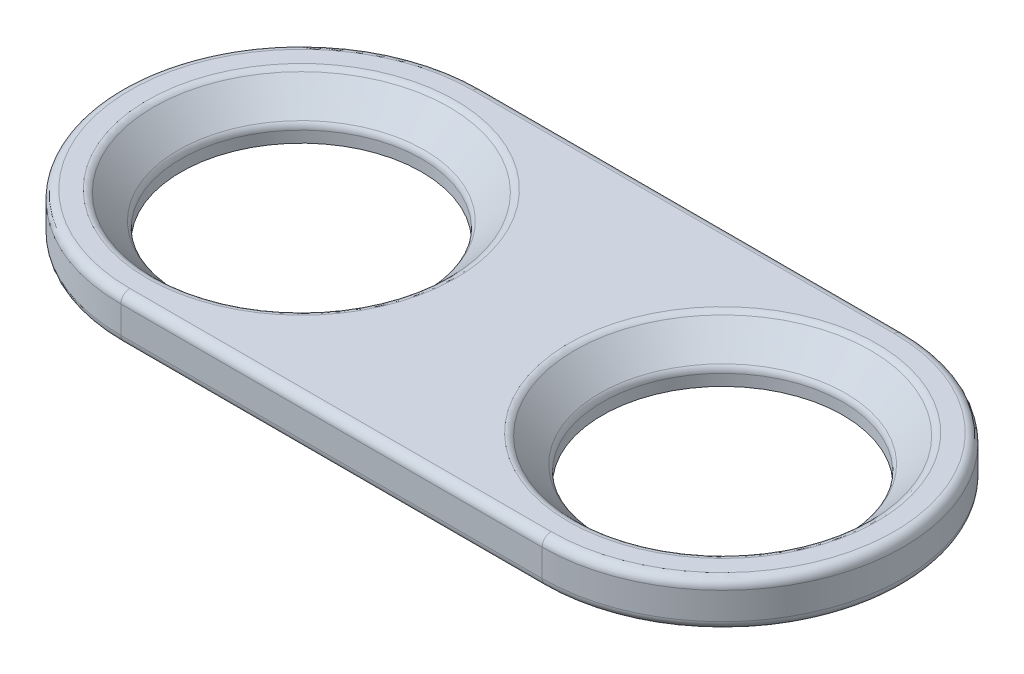
ISO-10303-21;
HEADER;
FILE_DESCRIPTION(('STEP AP214'),'2;1');
FILE_NAME('part.step','',(''),(''),'','','');
FILE_SCHEMA(('AUTOMOTIVE_DESIGN { 1 0 10303 214 1 1 1 1 }'));
ENDSEC;
DATA;
#1=APPLICATION_CONTEXT('core data for automotive mechanical design processes');
#2=APPLICATION_PROTOCOL_DEFINITION('international standard','automotive_design',2000,#1);
#3=PRODUCT_CONTEXT('',#1,'mechanical');
#4=PRODUCT('Part','Part','',(#3));
#5=PRODUCT_RELATED_PRODUCT_CATEGORY('part','',(#4));
#6=PRODUCT_DEFINITION_FORMATION('','',#4);
#7=PRODUCT_DEFINITION_CONTEXT('part definition',#1,'design');
#8=PRODUCT_DEFINITION('design','',#6,#7);
#9=PRODUCT_DEFINITION_SHAPE('','',#8);
#10=(LENGTH_UNIT() NAMED_UNIT(*) SI_UNIT(.MILLI.,.METRE.));
#11=(NAMED_UNIT(*) PLANE_ANGLE_UNIT() SI_UNIT($,.RADIAN.));
#12=(NAMED_UNIT(*) SI_UNIT($,.STERADIAN.) SOLID_ANGLE_UNIT());
#13=UNCERTAINTY_MEASURE_WITH_UNIT(LENGTH_MEASURE(1.E-05),#10,'distance_accuracy_value','');
#14=(GEOMETRIC_REPRESENTATION_CONTEXT(3) GLOBAL_UNCERTAINTY_ASSIGNED_CONTEXT((#13)) GLOBAL_UNIT_ASSIGNED_CONTEXT((#10,
#11,#12)) REPRESENTATION_CONTEXT('',''));
#15=CARTESIAN_POINT('',(0.,0.,0.));
#16=DIRECTION('',(0.,0.,1.));
#17=DIRECTION('',(1.,0.,0.));
#18=AXIS2_PLACEMENT_3D('',#15,#16,#17);
#19=CARTESIAN_POINT('',(-7.,1.5,0.));
#20=DIRECTION('',(0.,1.,0.));
#21=DIRECTION('',(0.,0.,1.));
#22=AXIS2_PLACEMENT_3D('',#19,#20,#21);
#23=PLANE('',#22);
#24=DIRECTION('',(-1.,0.,0.));
#25=VECTOR('',#24,1.);
#26=CARTESIAN_POINT('',(-7.,1.5,-5.7));
#27=LINE('',#26,#25);
#28=CARTESIAN_POINT('',(7.,1.5,-5.7));
#29=VERTEX_POINT('',#28);
#30=CARTESIAN_POINT('',(-7.,1.5,-5.7));
#31=VERTEX_POINT('',#30);
#32=EDGE_CURVE('E50',#29,#31,#27,.T.);
#33=ORIENTED_EDGE('',*,*,#32,.T.);
#34=CARTESIAN_POINT('',(-7.,1.5,0.));
#35=DIRECTION('',(0.,1.,0.));
#36=DIRECTION('',(0.,0.,1.));
#37=AXIS2_PLACEMENT_3D('',#34,#35,#36);
#38=CIRCLE('',#37,5.7);
#39=CARTESIAN_POINT('',(-7.,1.5,5.7));
#40=VERTEX_POINT('',#39);
#41=EDGE_CURVE('E106',#31,#40,#38,.T.);
#42=ORIENTED_EDGE('',*,*,#41,.T.);
#43=DIRECTION('',(1.,0.,0.));
#44=VECTOR('',#43,1.);
#45=CARTESIAN_POINT('',(7.,1.5,5.7));
#46=LINE('',#45,#44);
#47=CARTESIAN_POINT('',(7.,1.5,5.7));
#48=VERTEX_POINT('',#47);
#49=EDGE_CURVE('E170',#40,#48,#46,.T.);
#50=ORIENTED_EDGE('',*,*,#49,.T.);
#51=CARTESIAN_POINT('',(7.,1.5,0.));
#52=DIRECTION('',(0.,1.,0.));
#53=DIRECTION('',(0.,0.,1.));
#54=AXIS2_PLACEMENT_3D('',#51,#52,#53);
#55=CIRCLE('',#54,5.7);
#56=EDGE_CURVE('E55',#48,#29,#55,.T.);
#57=ORIENTED_EDGE('',*,*,#56,.T.);
#58=EDGE_LOOP('',(#33,#42,#50,#57));
#59=FACE_BOUND('',#58,.T.);
#60=CARTESIAN_POINT('',(7.,1.5,0.));
#61=DIRECTION('',(0.,1.,0.));
#62=DIRECTION('',(0.,0.,1.));
#63=AXIS2_PLACEMENT_3D('',#60,#61,#62);
#64=CIRCLE('',#63,5.12426406871194);
#65=CARTESIAN_POINT('',(7.,1.5,5.12426406871194));
#66=VERTEX_POINT('',#65);
#67=EDGE_CURVE('E167',#66,#66,#64,.F.);
#68=ORIENTED_EDGE('',*,*,#67,.T.);
#69=EDGE_LOOP('',(#68));
#70=FACE_BOUND('',#69,.T.);
#71=CARTESIAN_POINT('',(-7.,1.5,0.));
#72=DIRECTION('',(0.,1.,0.));
#73=DIRECTION('',(0.,0.,1.));
#74=AXIS2_PLACEMENT_3D('',#71,#72,#73);
#75=CIRCLE('',#74,5.12426406871194);
#76=CARTESIAN_POINT('',(-7.,1.5,5.12426406871194));
#77=VERTEX_POINT('',#76);
#78=EDGE_CURVE('E164',#77,#77,#75,.F.);
#79=ORIENTED_EDGE('',*,*,#78,.T.);
#80=EDGE_LOOP('',(#79));
#81=FACE_BOUND('',#80,.T.);
#82=ADVANCED_FACE('F33',(#59,#70,#81),#23,.T.);
#83=CARTESIAN_POINT('',(-7.,0.,0.));
#84=DIRECTION('',(0.,1.,0.));
#85=DIRECTION('',(0.,0.,1.));
#86=AXIS2_PLACEMENT_3D('',#83,#84,#85);
#87=PLANE('',#86);
#88=CARTESIAN_POINT('',(-7.,0.,0.));
#89=DIRECTION('',(0.,1.,0.));
#90=DIRECTION('',(0.,0.,1.));
#91=AXIS2_PLACEMENT_3D('',#88,#89,#90);
#92=CIRCLE('',#91,5.7);
#93=CARTESIAN_POINT('',(-7.,0.,5.7));
#94=VERTEX_POINT('',#93);
#95=CARTESIAN_POINT('',(-7.,0.,-5.7));
#96=VERTEX_POINT('',#95);
#97=EDGE_CURVE('E147',#94,#96,#92,.F.);
#98=ORIENTED_EDGE('',*,*,#97,.T.);
#99=DIRECTION('',(-1.,0.,0.));
#100=VECTOR('',#99,1.);
#101=CARTESIAN_POINT('',(-7.,0.,-5.7));
#102=LINE('',#101,#100);
#103=CARTESIAN_POINT('',(7.,0.,-5.7));
#104=VERTEX_POINT('',#103);
#105=EDGE_CURVE('E153',#96,#104,#102,.F.);
#106=ORIENTED_EDGE('',*,*,#105,.T.);
#107=CARTESIAN_POINT('',(7.,0.,0.));
#108=DIRECTION('',(0.,1.,0.));
#109=DIRECTION('',(0.,0.,1.));
#110=AXIS2_PLACEMENT_3D('',#107,#108,#109);
#111=CIRCLE('',#110,5.7);
#112=CARTESIAN_POINT('',(7.,0.,5.7));
#113=VERTEX_POINT('',#112);
#114=EDGE_CURVE('E151',#104,#113,#111,.F.);
#115=ORIENTED_EDGE('',*,*,#114,.T.);
#116=DIRECTION('',(1.,0.,0.));
#117=VECTOR('',#116,1.);
#118=CARTESIAN_POINT('',(-7.,0.,5.7));
#119=LINE('',#118,#117);
#120=EDGE_CURVE('E149',#113,#94,#119,.F.);
#121=ORIENTED_EDGE('',*,*,#120,.T.);
#122=EDGE_LOOP('',(#98,#106,#115,#121));
#123=FACE_BOUND('',#122,.T.);
#124=CARTESIAN_POINT('',(-7.,0.,0.));
#125=DIRECTION('',(0.,1.,0.));
#126=DIRECTION('',(0.,0.,1.));
#127=AXIS2_PLACEMENT_3D('',#124,#125,#126);
#128=CIRCLE('',#127,4.);
#129=CARTESIAN_POINT('',(-7.,0.,4.));
#130=VERTEX_POINT('',#129);
#131=EDGE_CURVE('E134',#130,#130,#128,.T.);
#132=ORIENTED_EDGE('',*,*,#131,.T.);
#133=EDGE_LOOP('',(#132));
#134=FACE_BOUND('',#133,.T.);
#135=CARTESIAN_POINT('',(7.,0.,0.));
#136=DIRECTION('',(0.,1.,0.));
#137=DIRECTION('',(0.,0.,1.));
#138=AXIS2_PLACEMENT_3D('',#135,#136,#137);
#139=CIRCLE('',#138,4.);
#140=CARTESIAN_POINT('',(7.,0.,4.));
#141=VERTEX_POINT('',#140);
#142=EDGE_CURVE('E139',#141,#141,#139,.T.);
#143=ORIENTED_EDGE('',*,*,#142,.T.);
#144=EDGE_LOOP('',(#143));
#145=FACE_BOUND('',#144,.T.);
#146=ADVANCED_FACE('F227',(#123,#134,#145),#87,.F.);
#147=CARTESIAN_POINT('',(-7.,1.5,0.));
#148=DIRECTION('',(0.,-1.,0.));
#149=DIRECTION('',(0.,0.,-1.));
#150=AXIS2_PLACEMENT_3D('',#147,#148,#149);
#151=CYLINDRICAL_SURFACE('',#150,6.);
#152=DIRECTION('',(0.,-1.,0.));
#153=VECTOR('',#152,1.);
#154=CARTESIAN_POINT('',(-7.,1.5,6.));
#155=LINE('',#154,#153);
#156=CARTESIAN_POINT('',(-7.,1.2,6.));
#157=VERTEX_POINT('',#156);
#158=CARTESIAN_POINT('',(-7.,0.3,6.));
#159=VERTEX_POINT('',#158);
#160=EDGE_CURVE('E119',#157,#159,#155,.T.);
#161=ORIENTED_EDGE('',*,*,#160,.F.);
#162=CARTESIAN_POINT('',(-7.,1.2,0.));
#163=DIRECTION('',(0.,1.,0.));
#164=DIRECTION('',(0.,0.,1.));
#165=AXIS2_PLACEMENT_3D('',#162,#163,#164);
#166=CIRCLE('',#165,6.);
#167=CARTESIAN_POINT('',(-7.,1.2,-6.));
#168=VERTEX_POINT('',#167);
#169=EDGE_CURVE('E104',#157,#168,#166,.F.);
#170=ORIENTED_EDGE('',*,*,#169,.T.);
#171=DIRECTION('',(0.,-1.,0.));
#172=VECTOR('',#171,1.);
#173=CARTESIAN_POINT('',(-7.,1.5,-6.));
#174=LINE('',#173,#172);
#175=CARTESIAN_POINT('',(-7.,0.3,-6.));
#176=VERTEX_POINT('',#175);
#177=EDGE_CURVE('E125',#168,#176,#174,.T.);
#178=ORIENTED_EDGE('',*,*,#177,.T.);
#179=CARTESIAN_POINT('',(-7.,0.3,0.));
#180=DIRECTION('',(0.,1.,0.));
#181=DIRECTION('',(0.,0.,1.));
#182=AXIS2_PLACEMENT_3D('',#179,#180,#181);
#183=CIRCLE('',#182,6.);
#184=EDGE_CURVE('E128',#176,#159,#183,.T.);
#185=ORIENTED_EDGE('',*,*,#184,.T.);
#186=EDGE_LOOP('',(#161,#170,#178,#185));
#187=FACE_BOUND('',#186,.T.);
#188=ADVANCED_FACE('F124',(#187),#151,.T.);
#189=CARTESIAN_POINT('',(7.,1.5,6.));
#190=DIRECTION('',(0.,0.,-1.));
#191=DIRECTION('',(-1.,0.,0.));
#192=AXIS2_PLACEMENT_3D('',#189,#190,#191);
#193=PLANE('',#192);
#194=ORIENTED_EDGE('',*,*,#160,.T.);
#195=DIRECTION('',(1.,0.,0.));
#196=VECTOR('',#195,1.);
#197=CARTESIAN_POINT('',(7.,0.3,6.));
#198=LINE('',#197,#196);
#199=CARTESIAN_POINT('',(7.,0.3,6.));
#200=VERTEX_POINT('',#199);
#201=EDGE_CURVE('E162',#159,#200,#198,.T.);
#202=ORIENTED_EDGE('',*,*,#201,.T.);
#203=DIRECTION('',(0.,-1.,0.));
#204=VECTOR('',#203,1.);
#205=CARTESIAN_POINT('',(7.,1.5,6.));
#206=LINE('',#205,#204);
#207=CARTESIAN_POINT('',(7.,1.2,6.));
#208=VERTEX_POINT('',#207);
#209=EDGE_CURVE('E136',#208,#200,#206,.T.);
#210=ORIENTED_EDGE('',*,*,#209,.F.);
#211=DIRECTION('',(1.,0.,0.));
#212=VECTOR('',#211,1.);
#213=CARTESIAN_POINT('',(-7.,1.2,6.));
#214=LINE('',#213,#212);
#215=EDGE_CURVE('E160',#208,#157,#214,.F.);
#216=ORIENTED_EDGE('',*,*,#215,.T.);
#217=EDGE_LOOP('',(#194,#202,#210,#216));
#218=FACE_BOUND('',#217,.T.);
#219=ADVANCED_FACE('F213',(#218),#193,.F.);
#220=CARTESIAN_POINT('',(7.,1.5,0.));
#221=DIRECTION('',(0.,-1.,0.));
#222=DIRECTION('',(0.,0.,-1.));
#223=AXIS2_PLACEMENT_3D('',#220,#221,#222);
#224=CYLINDRICAL_SURFACE('',#223,6.);
#225=ORIENTED_EDGE('',*,*,#209,.T.);
#226=CARTESIAN_POINT('',(7.,0.3,0.));
#227=DIRECTION('',(0.,1.,0.));
#228=DIRECTION('',(0.,0.,1.));
#229=AXIS2_PLACEMENT_3D('',#226,#227,#228);
#230=CIRCLE('',#229,6.);
#231=CARTESIAN_POINT('',(7.,0.3,-6.));
#232=VERTEX_POINT('',#231);
#233=EDGE_CURVE('E158',#200,#232,#230,.T.);
#234=ORIENTED_EDGE('',*,*,#233,.T.);
#235=DIRECTION('',(0.,-1.,0.));
#236=VECTOR('',#235,1.);
#237=CARTESIAN_POINT('',(7.,1.5,-6.));
#238=LINE('',#237,#236);
#239=CARTESIAN_POINT('',(7.,1.2,-6.));
#240=VERTEX_POINT('',#239);
#241=EDGE_CURVE('E133',#240,#232,#238,.T.);
#242=ORIENTED_EDGE('',*,*,#241,.F.);
#243=CARTESIAN_POINT('',(7.,1.2,0.));
#244=DIRECTION('',(0.,1.,0.));
#245=DIRECTION('',(0.,0.,1.));
#246=AXIS2_PLACEMENT_3D('',#243,#244,#245);
#247=CIRCLE('',#246,6.);
#248=EDGE_CURVE('E156',#240,#208,#247,.F.);
#249=ORIENTED_EDGE('',*,*,#248,.T.);
#250=EDGE_LOOP('',(#225,#234,#242,#249));
#251=FACE_BOUND('',#250,.T.);
#252=ADVANCED_FACE('F210',(#251),#224,.T.);
#253=CARTESIAN_POINT('',(-7.,1.5,-6.));
#254=DIRECTION('',(0.,0.,1.));
#255=DIRECTION('',(1.,0.,0.));
#256=AXIS2_PLACEMENT_3D('',#253,#254,#255);
#257=PLANE('',#256);
#258=ORIENTED_EDGE('',*,*,#241,.T.);
#259=DIRECTION('',(-1.,0.,0.));
#260=VECTOR('',#259,1.);
#261=CARTESIAN_POINT('',(-7.,0.3,-6.));
#262=LINE('',#261,#260);
#263=EDGE_CURVE('E118',#232,#176,#262,.T.);
#264=ORIENTED_EDGE('',*,*,#263,.T.);
#265=ORIENTED_EDGE('',*,*,#177,.F.);
#266=DIRECTION('',(-1.,0.,0.));
#267=VECTOR('',#266,1.);
#268=CARTESIAN_POINT('',(7.,1.2,-6.));
#269=LINE('',#268,#267);
#270=EDGE_CURVE('E112',#168,#240,#269,.F.);
#271=ORIENTED_EDGE('',*,*,#270,.T.);
#272=EDGE_LOOP('',(#258,#264,#265,#271));
#273=FACE_BOUND('',#272,.T.);
#274=ADVANCED_FACE('F131',(#273),#257,.F.);
#275=CARTESIAN_POINT('',(-7.,1.5,0.));
#276=DIRECTION('',(0.,-1.,0.));
#277=DIRECTION('',(0.,0.,-1.));
#278=AXIS2_PLACEMENT_3D('',#275,#276,#277);
#279=CYLINDRICAL_SURFACE('',#278,4.);
#280=CARTESIAN_POINT('',(-7.,0.375735931288063,0.));
#281=DIRECTION('',(0.,-1.,0.));
#282=DIRECTION('',(0.,0.,-1.));
#283=AXIS2_PLACEMENT_3D('',#280,#281,#282);
#284=CIRCLE('',#283,4.);
#285=CARTESIAN_POINT('',(-7.,0.375735931288063,-4.));
#286=VERTEX_POINT('',#285);
#287=EDGE_CURVE('E184',#286,#286,#284,.F.);
#288=ORIENTED_EDGE('',*,*,#287,.T.);
#289=EDGE_LOOP('',(#288));
#290=FACE_BOUND('',#289,.T.);
#291=ORIENTED_EDGE('',*,*,#131,.F.);
#292=EDGE_LOOP('',(#291));
#293=FACE_BOUND('',#292,.T.);
#294=ADVANCED_FACE('F252',(#290,#293),#279,.F.);
#295=CARTESIAN_POINT('',(7.,1.5,0.));
#296=DIRECTION('',(0.,-1.,0.));
#297=DIRECTION('',(0.,0.,-1.));
#298=AXIS2_PLACEMENT_3D('',#295,#296,#297);
#299=CYLINDRICAL_SURFACE('',#298,4.);
#300=CARTESIAN_POINT('',(7.,0.375735931288064,0.));
#301=DIRECTION('',(0.,-1.,0.));
#302=DIRECTION('',(0.,0.,-1.));
#303=AXIS2_PLACEMENT_3D('',#300,#301,#302);
#304=CIRCLE('',#303,4.);
#305=CARTESIAN_POINT('',(7.,0.375735931288064,-4.));
#306=VERTEX_POINT('',#305);
#307=EDGE_CURVE('E127',#306,#306,#304,.F.);
#308=ORIENTED_EDGE('',*,*,#307,.T.);
#309=EDGE_LOOP('',(#308));
#310=FACE_BOUND('',#309,.T.);
#311=ORIENTED_EDGE('',*,*,#142,.F.);
#312=EDGE_LOOP('',(#311));
#313=FACE_BOUND('',#312,.T.);
#314=ADVANCED_FACE('F266',(#310,#313),#299,.F.);
#315=CARTESIAN_POINT('',(-7.,0.499999999999992,0.));
#316=DIRECTION('',(0.,1.,0.));
#317=DIRECTION('',(0.,0.,1.));
#318=AXIS2_PLACEMENT_3D('',#315,#316,#317);
#319=CONICAL_SURFACE('',#318,4.,0.78539816339745);
#320=CARTESIAN_POINT('',(-7.,0.587867965644028,0.));
#321=DIRECTION('',(0.,-1.,0.));
#322=DIRECTION('',(0.,0.,-1.));
#323=AXIS2_PLACEMENT_3D('',#320,#321,#322);
#324=CIRCLE('',#323,4.08786796564404);
#325=CARTESIAN_POINT('',(-7.,0.587867965644028,-4.08786796564404));
#326=VERTEX_POINT('',#325);
#327=EDGE_CURVE('E11',#326,#326,#324,.T.);
#328=ORIENTED_EDGE('',*,*,#327,.T.);
#329=EDGE_LOOP('',(#328));
#330=FACE_BOUND('',#329,.T.);
#331=CARTESIAN_POINT('',(-7.,1.41213203435596,0.));
#332=DIRECTION('',(0.,-1.,0.));
#333=DIRECTION('',(0.,0.,-1.));
#334=AXIS2_PLACEMENT_3D('',#331,#332,#333);
#335=CIRCLE('',#334,4.91213203435598);
#336=CARTESIAN_POINT('',(-7.,1.41213203435596,-4.91213203435598));
#337=VERTEX_POINT('',#336);
#338=EDGE_CURVE('E42',#337,#337,#335,.F.);
#339=ORIENTED_EDGE('',*,*,#338,.T.);
#340=EDGE_LOOP('',(#339));
#341=FACE_BOUND('',#340,.T.);
#342=ADVANCED_FACE('F263',(#330,#341),#319,.F.);
#343=CARTESIAN_POINT('',(7.,0.499999999999993,0.));
#344=DIRECTION('',(0.,1.,0.));
#345=DIRECTION('',(0.,0.,1.));
#346=AXIS2_PLACEMENT_3D('',#343,#344,#345);
#347=CONICAL_SURFACE('',#346,4.,0.78539816339745);
#348=CARTESIAN_POINT('',(7.,0.587867965644029,0.));
#349=DIRECTION('',(0.,-1.,0.));
#350=DIRECTION('',(0.,0.,-1.));
#351=AXIS2_PLACEMENT_3D('',#348,#349,#350);
#352=CIRCLE('',#351,4.08786796564404);
#353=CARTESIAN_POINT('',(7.,0.587867965644029,-4.08786796564404));
#354=VERTEX_POINT('',#353);
#355=EDGE_CURVE('E181',#354,#354,#352,.T.);
#356=ORIENTED_EDGE('',*,*,#355,.T.);
#357=EDGE_LOOP('',(#356));
#358=FACE_BOUND('',#357,.T.);
#359=CARTESIAN_POINT('',(7.,1.41213203435596,0.));
#360=DIRECTION('',(0.,-1.,0.));
#361=DIRECTION('',(0.,0.,-1.));
#362=AXIS2_PLACEMENT_3D('',#359,#360,#361);
#363=CIRCLE('',#362,4.91213203435598);
#364=CARTESIAN_POINT('',(7.,1.41213203435596,-4.91213203435598));
#365=VERTEX_POINT('',#364);
#366=EDGE_CURVE('E178',#365,#365,#363,.F.);
#367=ORIENTED_EDGE('',*,*,#366,.T.);
#368=EDGE_LOOP('',(#367));
#369=FACE_BOUND('',#368,.T.);
#370=ADVANCED_FACE('F242',(#358,#369),#347,.F.);
#371=CARTESIAN_POINT('',(7.,0.3,5.7));
#372=DIRECTION('',(1.,0.,0.));
#373=DIRECTION('',(0.,0.,-1.));
#374=AXIS2_PLACEMENT_3D('',#371,#372,#373);
#375=CYLINDRICAL_SURFACE('',#374,0.3);
#376=CARTESIAN_POINT('',(-7.,0.3,5.7));
#377=DIRECTION('',(-1.,0.,0.));
#378=DIRECTION('',(0.,0.,1.));
#379=AXIS2_PLACEMENT_3D('',#376,#377,#378);
#380=CIRCLE('',#379,0.3);
#381=EDGE_CURVE('E193',#94,#159,#380,.T.);
#382=ORIENTED_EDGE('',*,*,#381,.F.);
#383=ORIENTED_EDGE('',*,*,#120,.F.);
#384=CARTESIAN_POINT('',(7.,0.3,5.7));
#385=DIRECTION('',(1.,0.,0.));
#386=DIRECTION('',(0.,0.,-1.));
#387=AXIS2_PLACEMENT_3D('',#384,#385,#386);
#388=CIRCLE('',#387,0.3);
#389=EDGE_CURVE('E196',#200,#113,#388,.T.);
#390=ORIENTED_EDGE('',*,*,#389,.F.);
#391=ORIENTED_EDGE('',*,*,#201,.F.);
#392=EDGE_LOOP('',(#382,#383,#390,#391));
#393=FACE_BOUND('',#392,.T.);
#394=ADVANCED_FACE('F217',(#393),#375,.T.);
#395=CARTESIAN_POINT('',(7.,0.3,0.));
#396=DIRECTION('',(0.,1.,0.));
#397=DIRECTION('',(0.,0.,1.));
#398=AXIS2_PLACEMENT_3D('',#395,#396,#397);
#399=TOROIDAL_SURFACE('',#398,5.7,0.3);
#400=ORIENTED_EDGE('',*,*,#389,.T.);
#401=ORIENTED_EDGE('',*,*,#114,.F.);
#402=CARTESIAN_POINT('',(7.,0.3,-5.7));
#403=DIRECTION('',(-1.,0.,0.));
#404=DIRECTION('',(0.,0.,1.));
#405=AXIS2_PLACEMENT_3D('',#402,#403,#404);
#406=CIRCLE('',#405,0.3);
#407=EDGE_CURVE('E191',#232,#104,#406,.T.);
#408=ORIENTED_EDGE('',*,*,#407,.F.);
#409=ORIENTED_EDGE('',*,*,#233,.F.);
#410=EDGE_LOOP('',(#400,#401,#408,#409));
#411=FACE_BOUND('',#410,.T.);
#412=ADVANCED_FACE('F234',(#411),#399,.T.);
#413=CARTESIAN_POINT('',(-7.,0.3,0.));
#414=DIRECTION('',(0.,1.,0.));
#415=DIRECTION('',(0.,0.,1.));
#416=AXIS2_PLACEMENT_3D('',#413,#414,#415);
#417=TOROIDAL_SURFACE('',#416,5.7,0.3);
#418=ORIENTED_EDGE('',*,*,#381,.T.);
#419=ORIENTED_EDGE('',*,*,#184,.F.);
#420=CARTESIAN_POINT('',(-7.,0.3,-5.7));
#421=DIRECTION('',(1.,0.,0.));
#422=DIRECTION('',(0.,0.,-1.));
#423=AXIS2_PLACEMENT_3D('',#420,#421,#422);
#424=CIRCLE('',#423,0.3);
#425=EDGE_CURVE('E189',#96,#176,#424,.T.);
#426=ORIENTED_EDGE('',*,*,#425,.F.);
#427=ORIENTED_EDGE('',*,*,#97,.F.);
#428=EDGE_LOOP('',(#418,#419,#426,#427));
#429=FACE_BOUND('',#428,.T.);
#430=ADVANCED_FACE('F223',(#429),#417,.T.);
#431=CARTESIAN_POINT('',(-7.,0.3,-5.7));
#432=DIRECTION('',(-1.,0.,0.));
#433=DIRECTION('',(0.,0.,1.));
#434=AXIS2_PLACEMENT_3D('',#431,#432,#433);
#435=CYLINDRICAL_SURFACE('',#434,0.3);
#436=ORIENTED_EDGE('',*,*,#407,.T.);
#437=ORIENTED_EDGE('',*,*,#105,.F.);
#438=ORIENTED_EDGE('',*,*,#425,.T.);
#439=ORIENTED_EDGE('',*,*,#263,.F.);
#440=EDGE_LOOP('',(#436,#437,#438,#439));
#441=FACE_BOUND('',#440,.T.);
#442=ADVANCED_FACE('F230',(#441),#435,.T.);
#443=CARTESIAN_POINT('',(7.,1.2,0.));
#444=DIRECTION('',(0.,1.,0.));
#445=DIRECTION('',(0.,0.,1.));
#446=AXIS2_PLACEMENT_3D('',#443,#444,#445);
#447=TOROIDAL_SURFACE('',#446,5.7,0.3);
#448=CARTESIAN_POINT('',(7.,1.2,5.7));
#449=DIRECTION('',(-1.,0.,0.));
#450=DIRECTION('',(0.,0.,1.));
#451=AXIS2_PLACEMENT_3D('',#448,#449,#450);
#452=CIRCLE('',#451,0.3);
#453=EDGE_CURVE('E108',#208,#48,#452,.T.);
#454=ORIENTED_EDGE('',*,*,#453,.F.);
#455=ORIENTED_EDGE('',*,*,#248,.F.);
#456=CARTESIAN_POINT('',(7.,1.2,-5.7));
#457=DIRECTION('',(-1.,0.,0.));
#458=DIRECTION('',(0.,0.,1.));
#459=AXIS2_PLACEMENT_3D('',#456,#457,#458);
#460=CIRCLE('',#459,0.3);
#461=EDGE_CURVE('E37',#29,#240,#460,.T.);
#462=ORIENTED_EDGE('',*,*,#461,.F.);
#463=ORIENTED_EDGE('',*,*,#56,.F.);
#464=EDGE_LOOP('',(#454,#455,#462,#463));
#465=FACE_BOUND('',#464,.T.);
#466=ADVANCED_FACE('F207',(#465),#447,.T.);
#467=CARTESIAN_POINT('',(-7.,1.2,-5.7));
#468=DIRECTION('',(1.,0.,0.));
#469=DIRECTION('',(0.,0.,-1.));
#470=AXIS2_PLACEMENT_3D('',#467,#468,#469);
#471=CYLINDRICAL_SURFACE('',#470,0.3);
#472=ORIENTED_EDGE('',*,*,#461,.T.);
#473=ORIENTED_EDGE('',*,*,#270,.F.);
#474=CARTESIAN_POINT('',(-7.,1.2,-5.7));
#475=DIRECTION('',(-1.,0.,0.));
#476=DIRECTION('',(0.,0.,1.));
#477=AXIS2_PLACEMENT_3D('',#474,#475,#476);
#478=CIRCLE('',#477,0.3);
#479=EDGE_CURVE('E100',#31,#168,#478,.T.);
#480=ORIENTED_EDGE('',*,*,#479,.F.);
#481=ORIENTED_EDGE('',*,*,#32,.F.);
#482=EDGE_LOOP('',(#472,#473,#480,#481));
#483=FACE_BOUND('',#482,.T.);
#484=ADVANCED_FACE('F113',(#483),#471,.T.);
#485=CARTESIAN_POINT('',(-7.,1.2,5.7));
#486=DIRECTION('',(-1.,0.,0.));
#487=DIRECTION('',(0.,0.,1.));
#488=AXIS2_PLACEMENT_3D('',#485,#486,#487);
#489=CYLINDRICAL_SURFACE('',#488,0.3);
#490=ORIENTED_EDGE('',*,*,#453,.T.);
#491=ORIENTED_EDGE('',*,*,#49,.F.);
#492=CARTESIAN_POINT('',(-7.,1.2,5.7));
#493=DIRECTION('',(-1.,0.,0.));
#494=DIRECTION('',(0.,0.,1.));
#495=AXIS2_PLACEMENT_3D('',#492,#493,#494);
#496=CIRCLE('',#495,0.3);
#497=EDGE_CURVE('E109',#157,#40,#496,.T.);
#498=ORIENTED_EDGE('',*,*,#497,.F.);
#499=ORIENTED_EDGE('',*,*,#215,.F.);
#500=EDGE_LOOP('',(#490,#491,#498,#499));
#501=FACE_BOUND('',#500,.T.);
#502=ADVANCED_FACE('F204',(#501),#489,.T.);
#503=CARTESIAN_POINT('',(-7.,1.2,0.));
#504=DIRECTION('',(0.,1.,0.));
#505=DIRECTION('',(0.,0.,1.));
#506=AXIS2_PLACEMENT_3D('',#503,#504,#505);
#507=TOROIDAL_SURFACE('',#506,5.7,0.3);
#508=ORIENTED_EDGE('',*,*,#479,.T.);
#509=ORIENTED_EDGE('',*,*,#169,.F.);
#510=ORIENTED_EDGE('',*,*,#497,.T.);
#511=ORIENTED_EDGE('',*,*,#41,.F.);
#512=EDGE_LOOP('',(#508,#509,#510,#511));
#513=FACE_BOUND('',#512,.T.);
#514=ADVANCED_FACE('F102',(#513),#507,.T.);
#515=CARTESIAN_POINT('',(7.,0.375735931288064,0.));
#516=DIRECTION('',(0.,-1.,0.));
#517=DIRECTION('',(0.,0.,-1.));
#518=AXIS2_PLACEMENT_3D('',#515,#516,#517);
#519=TOROIDAL_SURFACE('',#518,4.3,0.3);
#520=ORIENTED_EDGE('',*,*,#355,.F.);
#521=EDGE_LOOP('',(#520));
#522=FACE_BOUND('',#521,.T.);
#523=ORIENTED_EDGE('',*,*,#307,.F.);
#524=EDGE_LOOP('',(#523));
#525=FACE_BOUND('',#524,.T.);
#526=ADVANCED_FACE('F282',(#522,#525),#519,.T.);
#527=CARTESIAN_POINT('',(-7.,0.375735931288063,0.));
#528=DIRECTION('',(0.,-1.,0.));
#529=DIRECTION('',(0.,0.,-1.));
#530=AXIS2_PLACEMENT_3D('',#527,#528,#529);
#531=TOROIDAL_SURFACE('',#530,4.3,0.3);
#532=ORIENTED_EDGE('',*,*,#327,.F.);
#533=EDGE_LOOP('',(#532));
#534=FACE_BOUND('',#533,.T.);
#535=ORIENTED_EDGE('',*,*,#287,.F.);
#536=EDGE_LOOP('',(#535));
#537=FACE_BOUND('',#536,.T.);
#538=ADVANCED_FACE('F285',(#534,#537),#531,.T.);
#539=CARTESIAN_POINT('',(7.,1.2,0.));
#540=DIRECTION('',(0.,1.,0.));
#541=DIRECTION('',(0.,0.,1.));
#542=AXIS2_PLACEMENT_3D('',#539,#540,#541);
#543=TOROIDAL_SURFACE('',#542,5.12426406871194,0.3);
#544=ORIENTED_EDGE('',*,*,#366,.F.);
#545=EDGE_LOOP('',(#544));
#546=FACE_BOUND('',#545,.T.);
#547=ORIENTED_EDGE('',*,*,#67,.F.);
#548=EDGE_LOOP('',(#547));
#549=FACE_BOUND('',#548,.T.);
#550=ADVANCED_FACE('F288',(#546,#549),#543,.T.);
#551=CARTESIAN_POINT('',(-7.,1.2,0.));
#552=DIRECTION('',(0.,1.,0.));
#553=DIRECTION('',(0.,0.,1.));
#554=AXIS2_PLACEMENT_3D('',#551,#552,#553);
#555=TOROIDAL_SURFACE('',#554,5.12426406871194,0.3);
#556=ORIENTED_EDGE('',*,*,#338,.F.);
#557=EDGE_LOOP('',(#556));
#558=FACE_BOUND('',#557,.T.);
#559=ORIENTED_EDGE('',*,*,#78,.F.);
#560=EDGE_LOOP('',(#559));
#561=FACE_BOUND('',#560,.T.);
#562=ADVANCED_FACE('F35',(#558,#561),#555,.T.);
#563=CLOSED_SHELL('',(#82,#146,#188,#219,#252,#274,#294,#314,#342,#370,#394,#412,#430,#442,#466,
#484,#502,#514,#526,#538,#550,#562));
#564=MANIFOLD_SOLID_BREP('B2',#563);
#565=ADVANCED_BREP_SHAPE_REPRESENTATION('',(#18,#564),#14);
#566=SHAPE_DEFINITION_REPRESENTATION(#9,#565);
ENDSEC;
END-ISO-10303-21;
